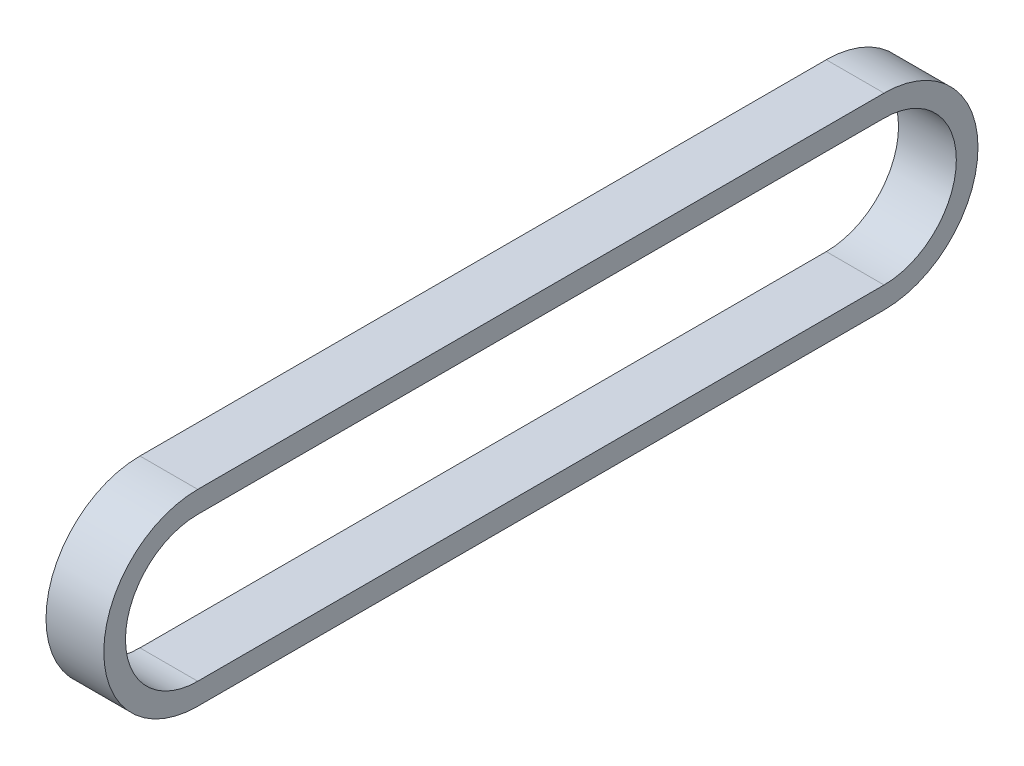
ISO-10303-21;
HEADER;
FILE_DESCRIPTION(('STEP AP214'),'2;1');
FILE_NAME('part.step','',(''),(''),'','','');
FILE_SCHEMA(('AUTOMOTIVE_DESIGN { 1 0 10303 214 1 1 1 1 }'));
ENDSEC;
DATA;
#1=APPLICATION_CONTEXT('core data for automotive mechanical design processes');
#2=APPLICATION_PROTOCOL_DEFINITION('international standard','automotive_design',2000,#1);
#3=PRODUCT_CONTEXT('',#1,'mechanical');
#4=PRODUCT('Part','Part','',(#3));
#5=PRODUCT_RELATED_PRODUCT_CATEGORY('part','',(#4));
#6=PRODUCT_DEFINITION_FORMATION('','',#4);
#7=PRODUCT_DEFINITION_CONTEXT('part definition',#1,'design');
#8=PRODUCT_DEFINITION('design','',#6,#7);
#9=PRODUCT_DEFINITION_SHAPE('','',#8);
#10=(LENGTH_UNIT() NAMED_UNIT(*) SI_UNIT(.MILLI.,.METRE.));
#11=(NAMED_UNIT(*) PLANE_ANGLE_UNIT() SI_UNIT($,.RADIAN.));
#12=(NAMED_UNIT(*) SI_UNIT($,.STERADIAN.) SOLID_ANGLE_UNIT());
#13=UNCERTAINTY_MEASURE_WITH_UNIT(LENGTH_MEASURE(1.E-05),#10,'distance_accuracy_value','');
#14=(GEOMETRIC_REPRESENTATION_CONTEXT(3) GLOBAL_UNCERTAINTY_ASSIGNED_CONTEXT((#13)) GLOBAL_UNIT_ASSIGNED_CONTEXT((#10,
#11,#12)) REPRESENTATION_CONTEXT('',''));
#15=CARTESIAN_POINT('',(0.,0.,0.));
#16=DIRECTION('',(0.,0.,1.));
#17=DIRECTION('',(1.,0.,0.));
#18=AXIS2_PLACEMENT_3D('',#15,#16,#17);
#19=CARTESIAN_POINT('',(8.,10.,0.));
#20=DIRECTION('',(-1.,0.,0.));
#21=DIRECTION('',(0.,0.,1.));
#22=AXIS2_PLACEMENT_3D('',#19,#20,#21);
#23=PLANE('',#22);
#24=CARTESIAN_POINT('',(8.,10.,0.));
#25=DIRECTION('',(1.,0.,0.));
#26=DIRECTION('',(0.,0.,1.));
#27=AXIS2_PLACEMENT_3D('',#24,#25,#26);
#28=CIRCLE('',#27,13.);
#29=CARTESIAN_POINT('',(8.,23.,0.));
#30=VERTEX_POINT('',#29);
#31=CARTESIAN_POINT('',(8.,-3.,0.));
#32=VERTEX_POINT('',#31);
#33=EDGE_CURVE('E157',#30,#32,#28,.T.);
#34=ORIENTED_EDGE('',*,*,#33,.T.);
#35=DIRECTION('',(0.,0.,-1.));
#36=VECTOR('',#35,1.);
#37=CARTESIAN_POINT('',(8.,-3.,0.));
#38=LINE('',#37,#36);
#39=CARTESIAN_POINT('',(8.,-3.,-95.));
#40=VERTEX_POINT('',#39);
#41=EDGE_CURVE('E161',#32,#40,#38,.T.);
#42=ORIENTED_EDGE('',*,*,#41,.T.);
#43=CARTESIAN_POINT('',(8.,10.,-95.));
#44=DIRECTION('',(1.,0.,0.));
#45=DIRECTION('',(0.,0.,1.));
#46=AXIS2_PLACEMENT_3D('',#43,#44,#45);
#47=CIRCLE('',#46,13.);
#48=CARTESIAN_POINT('',(8.,23.,-95.));
#49=VERTEX_POINT('',#48);
#50=EDGE_CURVE('E165',#40,#49,#47,.T.);
#51=ORIENTED_EDGE('',*,*,#50,.T.);
#52=DIRECTION('',(0.,0.,1.));
#53=VECTOR('',#52,1.);
#54=CARTESIAN_POINT('',(8.,23.,0.));
#55=LINE('',#54,#53);
#56=EDGE_CURVE('E168',#49,#30,#55,.T.);
#57=ORIENTED_EDGE('',*,*,#56,.T.);
#58=EDGE_LOOP('',(#34,#42,#51,#57));
#59=FACE_BOUND('',#58,.T.);
#60=CARTESIAN_POINT('',(8.,10.,0.));
#61=DIRECTION('',(1.,0.,0.));
#62=DIRECTION('',(0.,0.,1.));
#63=AXIS2_PLACEMENT_3D('',#60,#61,#62);
#64=CIRCLE('',#63,10.);
#65=CARTESIAN_POINT('',(8.,20.,0.));
#66=VERTEX_POINT('',#65);
#67=CARTESIAN_POINT('',(8.,0.,0.));
#68=VERTEX_POINT('',#67);
#69=EDGE_CURVE('E109',#66,#68,#64,.T.);
#70=ORIENTED_EDGE('',*,*,#69,.F.);
#71=DIRECTION('',(0.,0.,1.));
#72=VECTOR('',#71,1.);
#73=CARTESIAN_POINT('',(8.,20.,0.));
#74=LINE('',#73,#72);
#75=CARTESIAN_POINT('',(8.,20.,-95.));
#76=VERTEX_POINT('',#75);
#77=EDGE_CURVE('E135',#76,#66,#74,.T.);
#78=ORIENTED_EDGE('',*,*,#77,.F.);
#79=CARTESIAN_POINT('',(8.,10.,-95.));
#80=DIRECTION('',(1.,0.,0.));
#81=DIRECTION('',(0.,0.,1.));
#82=AXIS2_PLACEMENT_3D('',#79,#80,#81);
#83=CIRCLE('',#82,10.);
#84=CARTESIAN_POINT('',(8.,0.,-95.));
#85=VERTEX_POINT('',#84);
#86=EDGE_CURVE('E131',#85,#76,#83,.T.);
#87=ORIENTED_EDGE('',*,*,#86,.F.);
#88=DIRECTION('',(0.,0.,-1.));
#89=VECTOR('',#88,1.);
#90=CARTESIAN_POINT('',(8.,0.,0.));
#91=LINE('',#90,#89);
#92=EDGE_CURVE('E118',#68,#85,#91,.T.);
#93=ORIENTED_EDGE('',*,*,#92,.F.);
#94=EDGE_LOOP('',(#70,#78,#87,#93));
#95=FACE_BOUND('',#94,.T.);
#96=ADVANCED_FACE('F43',(#59,#95),#23,.F.);
#97=CARTESIAN_POINT('',(0.,10.,0.));
#98=DIRECTION('',(-1.,0.,0.));
#99=DIRECTION('',(0.,0.,1.));
#100=AXIS2_PLACEMENT_3D('',#97,#98,#99);
#101=PLANE('',#100);
#102=CARTESIAN_POINT('',(0.,10.,0.));
#103=DIRECTION('',(1.,0.,0.));
#104=DIRECTION('',(0.,0.,1.));
#105=AXIS2_PLACEMENT_3D('',#102,#103,#104);
#106=CIRCLE('',#105,13.);
#107=CARTESIAN_POINT('',(0.,23.,0.));
#108=VERTEX_POINT('',#107);
#109=CARTESIAN_POINT('',(0.,-3.,0.));
#110=VERTEX_POINT('',#109);
#111=EDGE_CURVE('E127',#108,#110,#106,.T.);
#112=ORIENTED_EDGE('',*,*,#111,.F.);
#113=DIRECTION('',(0.,0.,1.));
#114=VECTOR('',#113,1.);
#115=CARTESIAN_POINT('',(0.,23.,0.));
#116=LINE('',#115,#114);
#117=CARTESIAN_POINT('',(0.,23.,-95.));
#118=VERTEX_POINT('',#117);
#119=EDGE_CURVE('E162',#118,#108,#116,.T.);
#120=ORIENTED_EDGE('',*,*,#119,.F.);
#121=CARTESIAN_POINT('',(0.,10.,-95.));
#122=DIRECTION('',(1.,0.,0.));
#123=DIRECTION('',(0.,0.,1.));
#124=AXIS2_PLACEMENT_3D('',#121,#122,#123);
#125=CIRCLE('',#124,13.);
#126=CARTESIAN_POINT('',(0.,-3.,-95.));
#127=VERTEX_POINT('',#126);
#128=EDGE_CURVE('E178',#127,#118,#125,.T.);
#129=ORIENTED_EDGE('',*,*,#128,.F.);
#130=DIRECTION('',(0.,0.,-1.));
#131=VECTOR('',#130,1.);
#132=CARTESIAN_POINT('',(0.,-3.,0.));
#133=LINE('',#132,#131);
#134=EDGE_CURVE('E175',#110,#127,#133,.T.);
#135=ORIENTED_EDGE('',*,*,#134,.F.);
#136=EDGE_LOOP('',(#112,#120,#129,#135));
#137=FACE_BOUND('',#136,.T.);
#138=DIRECTION('',(0.,0.,1.));
#139=VECTOR('',#138,1.);
#140=CARTESIAN_POINT('',(0.,20.,0.));
#141=LINE('',#140,#139);
#142=CARTESIAN_POINT('',(0.,20.,-95.));
#143=VERTEX_POINT('',#142);
#144=CARTESIAN_POINT('',(0.,20.,0.));
#145=VERTEX_POINT('',#144);
#146=EDGE_CURVE('E119',#143,#145,#141,.T.);
#147=ORIENTED_EDGE('',*,*,#146,.T.);
#148=CARTESIAN_POINT('',(0.,10.,0.));
#149=DIRECTION('',(1.,0.,0.));
#150=DIRECTION('',(0.,0.,1.));
#151=AXIS2_PLACEMENT_3D('',#148,#149,#150);
#152=CIRCLE('',#151,10.);
#153=CARTESIAN_POINT('',(0.,0.,0.));
#154=VERTEX_POINT('',#153);
#155=EDGE_CURVE('E67',#145,#154,#152,.T.);
#156=ORIENTED_EDGE('',*,*,#155,.T.);
#157=DIRECTION('',(0.,0.,-1.));
#158=VECTOR('',#157,1.);
#159=CARTESIAN_POINT('',(0.,0.,0.));
#160=LINE('',#159,#158);
#161=CARTESIAN_POINT('',(0.,0.,-95.));
#162=VERTEX_POINT('',#161);
#163=EDGE_CURVE('E125',#154,#162,#160,.T.);
#164=ORIENTED_EDGE('',*,*,#163,.T.);
#165=CARTESIAN_POINT('',(0.,10.,-95.));
#166=DIRECTION('',(1.,0.,0.));
#167=DIRECTION('',(0.,0.,1.));
#168=AXIS2_PLACEMENT_3D('',#165,#166,#167);
#169=CIRCLE('',#168,10.);
#170=EDGE_CURVE('E144',#162,#143,#169,.T.);
#171=ORIENTED_EDGE('',*,*,#170,.T.);
#172=EDGE_LOOP('',(#147,#156,#164,#171));
#173=FACE_BOUND('',#172,.T.);
#174=ADVANCED_FACE('F201',(#137,#173),#101,.T.);
#175=CARTESIAN_POINT('',(8.,10.,0.));
#176=DIRECTION('',(-1.,0.,0.));
#177=DIRECTION('',(0.,0.,1.));
#178=AXIS2_PLACEMENT_3D('',#175,#176,#177);
#179=CYLINDRICAL_SURFACE('',#178,13.);
#180=ORIENTED_EDGE('',*,*,#111,.T.);
#181=DIRECTION('',(-1.,0.,0.));
#182=VECTOR('',#181,1.);
#183=CARTESIAN_POINT('',(8.,-3.,0.));
#184=LINE('',#183,#182);
#185=EDGE_CURVE('E11',#32,#110,#184,.T.);
#186=ORIENTED_EDGE('',*,*,#185,.F.);
#187=ORIENTED_EDGE('',*,*,#33,.F.);
#188=DIRECTION('',(-1.,0.,0.));
#189=VECTOR('',#188,1.);
#190=CARTESIAN_POINT('',(8.,23.,0.));
#191=LINE('',#190,#189);
#192=EDGE_CURVE('E171',#30,#108,#191,.T.);
#193=ORIENTED_EDGE('',*,*,#192,.T.);
#194=EDGE_LOOP('',(#180,#186,#187,#193));
#195=FACE_BOUND('',#194,.T.);
#196=ADVANCED_FACE('F45',(#195),#179,.T.);
#197=CARTESIAN_POINT('',(8.,-3.,0.));
#198=DIRECTION('',(0.,1.,0.));
#199=DIRECTION('',(0.,0.,1.));
#200=AXIS2_PLACEMENT_3D('',#197,#198,#199);
#201=PLANE('',#200);
#202=ORIENTED_EDGE('',*,*,#134,.T.);
#203=DIRECTION('',(-1.,0.,0.));
#204=VECTOR('',#203,1.);
#205=CARTESIAN_POINT('',(8.,-3.,-95.));
#206=LINE('',#205,#204);
#207=EDGE_CURVE('E52',#40,#127,#206,.T.);
#208=ORIENTED_EDGE('',*,*,#207,.F.);
#209=ORIENTED_EDGE('',*,*,#41,.F.);
#210=ORIENTED_EDGE('',*,*,#185,.T.);
#211=EDGE_LOOP('',(#202,#208,#209,#210));
#212=FACE_BOUND('',#211,.T.);
#213=ADVANCED_FACE('F211',(#212),#201,.F.);
#214=CARTESIAN_POINT('',(8.,10.,-95.));
#215=DIRECTION('',(-1.,0.,0.));
#216=DIRECTION('',(0.,0.,1.));
#217=AXIS2_PLACEMENT_3D('',#214,#215,#216);
#218=CYLINDRICAL_SURFACE('',#217,13.);
#219=ORIENTED_EDGE('',*,*,#128,.T.);
#220=DIRECTION('',(-1.,0.,0.));
#221=VECTOR('',#220,1.);
#222=CARTESIAN_POINT('',(8.,23.,-95.));
#223=LINE('',#222,#221);
#224=EDGE_CURVE('E186',#49,#118,#223,.T.);
#225=ORIENTED_EDGE('',*,*,#224,.F.);
#226=ORIENTED_EDGE('',*,*,#50,.F.);
#227=ORIENTED_EDGE('',*,*,#207,.T.);
#228=EDGE_LOOP('',(#219,#225,#226,#227));
#229=FACE_BOUND('',#228,.T.);
#230=ADVANCED_FACE('F195',(#229),#218,.T.);
#231=CARTESIAN_POINT('',(8.,23.,0.));
#232=DIRECTION('',(0.,-1.,0.));
#233=DIRECTION('',(0.,0.,-1.));
#234=AXIS2_PLACEMENT_3D('',#231,#232,#233);
#235=PLANE('',#234);
#236=ORIENTED_EDGE('',*,*,#119,.T.);
#237=ORIENTED_EDGE('',*,*,#192,.F.);
#238=ORIENTED_EDGE('',*,*,#56,.F.);
#239=ORIENTED_EDGE('',*,*,#224,.T.);
#240=EDGE_LOOP('',(#236,#237,#238,#239));
#241=FACE_BOUND('',#240,.T.);
#242=ADVANCED_FACE('F205',(#241),#235,.F.);
#243=CARTESIAN_POINT('',(8.,10.,0.));
#244=DIRECTION('',(-1.,0.,0.));
#245=DIRECTION('',(0.,0.,1.));
#246=AXIS2_PLACEMENT_3D('',#243,#244,#245);
#247=CYLINDRICAL_SURFACE('',#246,10.);
#248=ORIENTED_EDGE('',*,*,#155,.F.);
#249=DIRECTION('',(-1.,0.,0.));
#250=VECTOR('',#249,1.);
#251=CARTESIAN_POINT('',(8.,20.,0.));
#252=LINE('',#251,#250);
#253=EDGE_CURVE('E113',#66,#145,#252,.T.);
#254=ORIENTED_EDGE('',*,*,#253,.F.);
#255=ORIENTED_EDGE('',*,*,#69,.T.);
#256=DIRECTION('',(-1.,0.,0.));
#257=VECTOR('',#256,1.);
#258=CARTESIAN_POINT('',(8.,0.,0.));
#259=LINE('',#258,#257);
#260=EDGE_CURVE('E112',#68,#154,#259,.T.);
#261=ORIENTED_EDGE('',*,*,#260,.T.);
#262=EDGE_LOOP('',(#248,#254,#255,#261));
#263=FACE_BOUND('',#262,.T.);
#264=ADVANCED_FACE('F111',(#263),#247,.F.);
#265=CARTESIAN_POINT('',(8.,0.,0.));
#266=DIRECTION('',(0.,1.,0.));
#267=DIRECTION('',(0.,0.,1.));
#268=AXIS2_PLACEMENT_3D('',#265,#266,#267);
#269=PLANE('',#268);
#270=ORIENTED_EDGE('',*,*,#163,.F.);
#271=ORIENTED_EDGE('',*,*,#260,.F.);
#272=ORIENTED_EDGE('',*,*,#92,.T.);
#273=DIRECTION('',(-1.,0.,0.));
#274=VECTOR('',#273,1.);
#275=CARTESIAN_POINT('',(8.,0.,-95.));
#276=LINE('',#275,#274);
#277=EDGE_CURVE('E128',#85,#162,#276,.T.);
#278=ORIENTED_EDGE('',*,*,#277,.T.);
#279=EDGE_LOOP('',(#270,#271,#272,#278));
#280=FACE_BOUND('',#279,.T.);
#281=ADVANCED_FACE('F122',(#280),#269,.T.);
#282=CARTESIAN_POINT('',(8.,10.,-95.));
#283=DIRECTION('',(-1.,0.,0.));
#284=DIRECTION('',(0.,0.,1.));
#285=AXIS2_PLACEMENT_3D('',#282,#283,#284);
#286=CYLINDRICAL_SURFACE('',#285,10.);
#287=ORIENTED_EDGE('',*,*,#170,.F.);
#288=ORIENTED_EDGE('',*,*,#277,.F.);
#289=ORIENTED_EDGE('',*,*,#86,.T.);
#290=DIRECTION('',(-1.,0.,0.));
#291=VECTOR('',#290,1.);
#292=CARTESIAN_POINT('',(8.,20.,-95.));
#293=LINE('',#292,#291);
#294=EDGE_CURVE('E59',#76,#143,#293,.T.);
#295=ORIENTED_EDGE('',*,*,#294,.T.);
#296=EDGE_LOOP('',(#287,#288,#289,#295));
#297=FACE_BOUND('',#296,.T.);
#298=ADVANCED_FACE('F234',(#297),#286,.F.);
#299=CARTESIAN_POINT('',(8.,20.,0.));
#300=DIRECTION('',(0.,-1.,0.));
#301=DIRECTION('',(0.,0.,-1.));
#302=AXIS2_PLACEMENT_3D('',#299,#300,#301);
#303=PLANE('',#302);
#304=ORIENTED_EDGE('',*,*,#146,.F.);
#305=ORIENTED_EDGE('',*,*,#294,.F.);
#306=ORIENTED_EDGE('',*,*,#77,.T.);
#307=ORIENTED_EDGE('',*,*,#253,.T.);
#308=EDGE_LOOP('',(#304,#305,#306,#307));
#309=FACE_BOUND('',#308,.T.);
#310=ADVANCED_FACE('F238',(#309),#303,.T.);
#311=CLOSED_SHELL('',(#96,#174,#196,#213,#230,#242,#264,#281,#298,#310));
#312=MANIFOLD_SOLID_BREP('B2',#311);
#313=ADVANCED_BREP_SHAPE_REPRESENTATION('',(#18,#312),#14);
#314=SHAPE_DEFINITION_REPRESENTATION(#9,#313);
ENDSEC;
END-ISO-10303-21;
